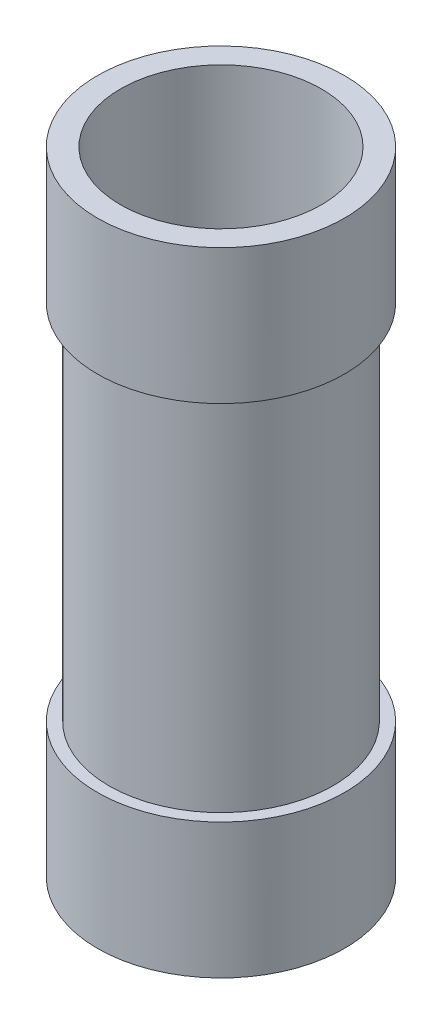
ISO-10303-21;
HEADER;
FILE_DESCRIPTION(('STEP AP214'),'2;1');
FILE_NAME('part.step','',(''),(''),'','','');
FILE_SCHEMA(('AUTOMOTIVE_DESIGN { 1 0 10303 214 1 1 1 1 }'));
ENDSEC;
DATA;
#1=APPLICATION_CONTEXT('core data for automotive mechanical design processes');
#2=APPLICATION_PROTOCOL_DEFINITION('international standard','automotive_design',2000,#1);
#3=PRODUCT_CONTEXT('',#1,'mechanical');
#4=PRODUCT('Part','Part','',(#3));
#5=PRODUCT_RELATED_PRODUCT_CATEGORY('part','',(#4));
#6=PRODUCT_DEFINITION_FORMATION('','',#4);
#7=PRODUCT_DEFINITION_CONTEXT('part definition',#1,'design');
#8=PRODUCT_DEFINITION('design','',#6,#7);
#9=PRODUCT_DEFINITION_SHAPE('','',#8);
#10=(LENGTH_UNIT() NAMED_UNIT(*) SI_UNIT(.MILLI.,.METRE.));
#11=(NAMED_UNIT(*) PLANE_ANGLE_UNIT() SI_UNIT($,.RADIAN.));
#12=(NAMED_UNIT(*) SI_UNIT($,.STERADIAN.) SOLID_ANGLE_UNIT());
#13=UNCERTAINTY_MEASURE_WITH_UNIT(LENGTH_MEASURE(1.E-05),#10,'distance_accuracy_value','');
#14=(GEOMETRIC_REPRESENTATION_CONTEXT(3) GLOBAL_UNCERTAINTY_ASSIGNED_CONTEXT((#13)) GLOBAL_UNIT_ASSIGNED_CONTEXT((#10,
#11,#12)) REPRESENTATION_CONTEXT('',''));
#15=CARTESIAN_POINT('',(0.,0.,0.));
#16=DIRECTION('',(0.,0.,1.));
#17=DIRECTION('',(1.,0.,0.));
#18=AXIS2_PLACEMENT_3D('',#15,#16,#17);
#19=CARTESIAN_POINT('',(0.,192.,0.));
#20=DIRECTION('',(0.,-1.,0.));
#21=DIRECTION('',(0.,0.,-1.));
#22=AXIS2_PLACEMENT_3D('',#19,#20,#21);
#23=CYLINDRICAL_SURFACE('',#22,37.5);
#24=CARTESIAN_POINT('',(0.,192.,0.));
#25=DIRECTION('',(0.,1.,0.));
#26=DIRECTION('',(0.,0.,1.));
#27=AXIS2_PLACEMENT_3D('',#24,#25,#26);
#28=CIRCLE('',#27,37.5);
#29=CARTESIAN_POINT('',(0.,192.,37.5));
#30=VERTEX_POINT('',#29);
#31=EDGE_CURVE('E11',#30,#30,#28,.T.);
#32=ORIENTED_EDGE('',*,*,#31,.F.);
#33=EDGE_LOOP('',(#32));
#34=FACE_BOUND('',#33,.T.);
#35=CARTESIAN_POINT('',(0.,151.,0.));
#36=DIRECTION('',(0.,-1.,0.));
#37=DIRECTION('',(0.,0.,-1.));
#38=AXIS2_PLACEMENT_3D('',#35,#36,#37);
#39=CIRCLE('',#38,37.5);
#40=CARTESIAN_POINT('',(0.,151.,-37.5));
#41=VERTEX_POINT('',#40);
#42=EDGE_CURVE('E47',#41,#41,#39,.T.);
#43=ORIENTED_EDGE('',*,*,#42,.F.);
#44=EDGE_LOOP('',(#43));
#45=FACE_BOUND('',#44,.T.);
#46=ADVANCED_FACE('F43',(#34,#45),#23,.T.);
#47=CARTESIAN_POINT('',(0.,192.,0.));
#48=DIRECTION('',(0.,1.,0.));
#49=DIRECTION('',(0.,0.,1.));
#50=AXIS2_PLACEMENT_3D('',#47,#48,#49);
#51=PLANE('',#50);
#52=ORIENTED_EDGE('',*,*,#31,.T.);
#53=EDGE_LOOP('',(#52));
#54=FACE_BOUND('',#53,.T.);
#55=CARTESIAN_POINT('',(0.,192.,0.));
#56=DIRECTION('',(0.,1.,0.));
#57=DIRECTION('',(0.,0.,1.));
#58=AXIS2_PLACEMENT_3D('',#55,#56,#57);
#59=CIRCLE('',#58,30.5);
#60=CARTESIAN_POINT('',(0.,192.,30.5));
#61=VERTEX_POINT('',#60);
#62=EDGE_CURVE('E56',#61,#61,#59,.T.);
#63=ORIENTED_EDGE('',*,*,#62,.F.);
#64=EDGE_LOOP('',(#63));
#65=FACE_BOUND('',#64,.T.);
#66=ADVANCED_FACE('F96',(#54,#65),#51,.T.);
#67=CARTESIAN_POINT('',(0.,0.,0.));
#68=DIRECTION('',(0.,1.,0.));
#69=DIRECTION('',(0.,0.,1.));
#70=AXIS2_PLACEMENT_3D('',#67,#68,#69);
#71=PLANE('',#70);
#72=CARTESIAN_POINT('',(0.,0.,0.));
#73=DIRECTION('',(0.,1.,0.));
#74=DIRECTION('',(0.,0.,1.));
#75=AXIS2_PLACEMENT_3D('',#72,#73,#74);
#76=CIRCLE('',#75,37.5);
#77=CARTESIAN_POINT('',(0.,0.,37.5));
#78=VERTEX_POINT('',#77);
#79=EDGE_CURVE('E51',#78,#78,#76,.T.);
#80=ORIENTED_EDGE('',*,*,#79,.F.);
#81=EDGE_LOOP('',(#80));
#82=FACE_BOUND('',#81,.T.);
#83=CARTESIAN_POINT('',(0.,0.,0.));
#84=DIRECTION('',(0.,1.,0.));
#85=DIRECTION('',(0.,0.,1.));
#86=AXIS2_PLACEMENT_3D('',#83,#84,#85);
#87=CIRCLE('',#86,30.5);
#88=CARTESIAN_POINT('',(0.,0.,30.5));
#89=VERTEX_POINT('',#88);
#90=EDGE_CURVE('E59',#89,#89,#87,.T.);
#91=ORIENTED_EDGE('',*,*,#90,.T.);
#92=EDGE_LOOP('',(#91));
#93=FACE_BOUND('',#92,.T.);
#94=ADVANCED_FACE('F80',(#82,#93),#71,.F.);
#95=CARTESIAN_POINT('',(0.,41.,0.));
#96=DIRECTION('',(0.,-1.,0.));
#97=DIRECTION('',(0.,0.,-1.));
#98=AXIS2_PLACEMENT_3D('',#95,#96,#97);
#99=CIRCLE('',#98,37.5);
#100=CARTESIAN_POINT('',(0.,41.,-37.5));
#101=VERTEX_POINT('',#100);
#102=EDGE_CURVE('E61',#101,#101,#99,.T.);
#103=ORIENTED_EDGE('',*,*,#102,.T.);
#104=EDGE_LOOP('',(#103));
#105=FACE_BOUND('',#104,.T.);
#106=ORIENTED_EDGE('',*,*,#79,.T.);
#107=EDGE_LOOP('',(#106));
#108=FACE_BOUND('',#107,.T.);
#109=ADVANCED_FACE('F45',(#105,#108),#23,.T.);
#110=CARTESIAN_POINT('',(0.,192.,0.));
#111=DIRECTION('',(0.,-1.,0.));
#112=DIRECTION('',(0.,0.,-1.));
#113=AXIS2_PLACEMENT_3D('',#110,#111,#112);
#114=CYLINDRICAL_SURFACE('',#113,30.5);
#115=ORIENTED_EDGE('',*,*,#62,.T.);
#116=EDGE_LOOP('',(#115));
#117=FACE_BOUND('',#116,.T.);
#118=ORIENTED_EDGE('',*,*,#90,.F.);
#119=EDGE_LOOP('',(#118));
#120=FACE_BOUND('',#119,.T.);
#121=ADVANCED_FACE('F82',(#117,#120),#114,.F.);
#122=CARTESIAN_POINT('',(0.,151.,0.));
#123=DIRECTION('',(0.,-1.,0.));
#124=DIRECTION('',(0.,0.,-1.));
#125=AXIS2_PLACEMENT_3D('',#122,#123,#124);
#126=PLANE('',#125);
#127=CARTESIAN_POINT('',(0.,151.,0.));
#128=DIRECTION('',(0.,-1.,0.));
#129=DIRECTION('',(0.,0.,-1.));
#130=AXIS2_PLACEMENT_3D('',#127,#128,#129);
#131=CIRCLE('',#130,34.);
#132=CARTESIAN_POINT('',(0.,151.,-34.));
#133=VERTEX_POINT('',#132);
#134=EDGE_CURVE('E63',#133,#133,#131,.T.);
#135=ORIENTED_EDGE('',*,*,#134,.F.);
#136=EDGE_LOOP('',(#135));
#137=FACE_BOUND('',#136,.T.);
#138=ORIENTED_EDGE('',*,*,#42,.T.);
#139=EDGE_LOOP('',(#138));
#140=FACE_BOUND('',#139,.T.);
#141=ADVANCED_FACE('F84',(#137,#140),#126,.T.);
#142=CARTESIAN_POINT('',(0.,41.,0.));
#143=DIRECTION('',(0.,-1.,0.));
#144=DIRECTION('',(0.,0.,-1.));
#145=AXIS2_PLACEMENT_3D('',#142,#143,#144);
#146=PLANE('',#145);
#147=CARTESIAN_POINT('',(0.,41.,0.));
#148=DIRECTION('',(0.,-1.,0.));
#149=DIRECTION('',(0.,0.,-1.));
#150=AXIS2_PLACEMENT_3D('',#147,#148,#149);
#151=CIRCLE('',#150,34.);
#152=CARTESIAN_POINT('',(0.,41.,-34.));
#153=VERTEX_POINT('',#152);
#154=EDGE_CURVE('E68',#153,#153,#151,.T.);
#155=ORIENTED_EDGE('',*,*,#154,.T.);
#156=EDGE_LOOP('',(#155));
#157=FACE_BOUND('',#156,.T.);
#158=ORIENTED_EDGE('',*,*,#102,.F.);
#159=EDGE_LOOP('',(#158));
#160=FACE_BOUND('',#159,.T.);
#161=ADVANCED_FACE('F90',(#157,#160),#146,.F.);
#162=CARTESIAN_POINT('',(0.,151.,0.));
#163=DIRECTION('',(0.,-1.,0.));
#164=DIRECTION('',(0.,0.,-1.));
#165=AXIS2_PLACEMENT_3D('',#162,#163,#164);
#166=CYLINDRICAL_SURFACE('',#165,34.);
#167=ORIENTED_EDGE('',*,*,#134,.T.);
#168=EDGE_LOOP('',(#167));
#169=FACE_BOUND('',#168,.T.);
#170=ORIENTED_EDGE('',*,*,#154,.F.);
#171=EDGE_LOOP('',(#170));
#172=FACE_BOUND('',#171,.T.);
#173=ADVANCED_FACE('F137',(#169,#172),#166,.T.);
#174=CLOSED_SHELL('',(#46,#66,#94,#109,#121,#141,#161,#173));
#175=MANIFOLD_SOLID_BREP('B2',#174);
#176=ADVANCED_BREP_SHAPE_REPRESENTATION('',(#18,#175),#14);
#177=SHAPE_DEFINITION_REPRESENTATION(#9,#176);
ENDSEC;
END-ISO-10303-21;
